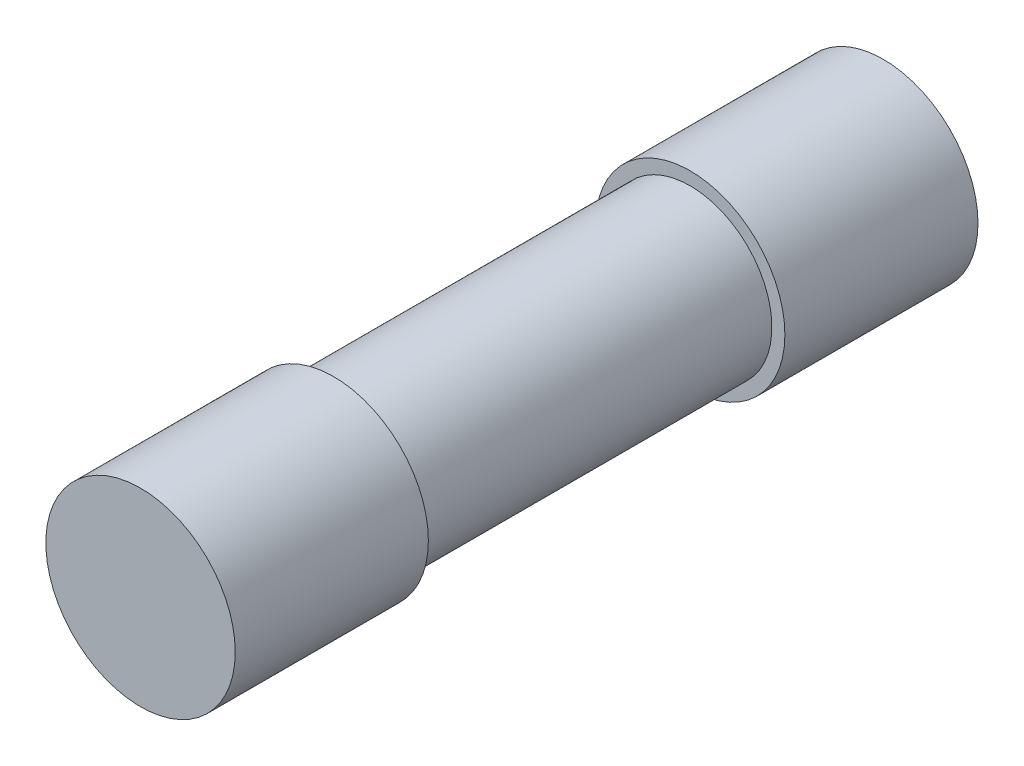
ISO-10303-21;
HEADER;
FILE_DESCRIPTION(('STEP AP214'),'2;1');
FILE_NAME('part.step','',(''),(''),'','','');
FILE_SCHEMA(('AUTOMOTIVE_DESIGN { 1 0 10303 214 1 1 1 1 }'));
ENDSEC;
DATA;
#1=APPLICATION_CONTEXT('core data for automotive mechanical design processes');
#2=APPLICATION_PROTOCOL_DEFINITION('international standard','automotive_design',2000,#1);
#3=PRODUCT_CONTEXT('',#1,'mechanical');
#4=PRODUCT('Part','Part','',(#3));
#5=PRODUCT_RELATED_PRODUCT_CATEGORY('part','',(#4));
#6=PRODUCT_DEFINITION_FORMATION('','',#4);
#7=PRODUCT_DEFINITION_CONTEXT('part definition',#1,'design');
#8=PRODUCT_DEFINITION('design','',#6,#7);
#9=PRODUCT_DEFINITION_SHAPE('','',#8);
#10=(LENGTH_UNIT() NAMED_UNIT(*) SI_UNIT(.MILLI.,.METRE.));
#11=(NAMED_UNIT(*) PLANE_ANGLE_UNIT() SI_UNIT($,.RADIAN.));
#12=(NAMED_UNIT(*) SI_UNIT($,.STERADIAN.) SOLID_ANGLE_UNIT());
#13=UNCERTAINTY_MEASURE_WITH_UNIT(LENGTH_MEASURE(1.E-05),#10,'distance_accuracy_value','');
#14=(GEOMETRIC_REPRESENTATION_CONTEXT(3) GLOBAL_UNCERTAINTY_ASSIGNED_CONTEXT((#13)) GLOBAL_UNIT_ASSIGNED_CONTEXT((#10,
#11,#12)) REPRESENTATION_CONTEXT('',''));
#15=CARTESIAN_POINT('',(0.,0.,0.));
#16=DIRECTION('',(0.,0.,1.));
#17=DIRECTION('',(1.,0.,0.));
#18=AXIS2_PLACEMENT_3D('',#15,#16,#17);
#19=CARTESIAN_POINT('',(0.,0.,-10.));
#20=DIRECTION('',(0.,0.,-1.));
#21=DIRECTION('',(-1.,0.,0.));
#22=AXIS2_PLACEMENT_3D('',#19,#20,#21);
#23=PLANE('',#22);
#24=CARTESIAN_POINT('',(0.,0.,-10.));
#25=DIRECTION('',(0.,0.,1.));
#26=DIRECTION('',(1.,0.,0.));
#27=AXIS2_PLACEMENT_3D('',#24,#25,#26);
#28=CIRCLE('',#27,2.55);
#29=CARTESIAN_POINT('',(2.55,0.,-10.));
#30=VERTEX_POINT('',#29);
#31=EDGE_CURVE('E16',#30,#30,#28,.T.);
#32=ORIENTED_EDGE('',*,*,#31,.F.);
#33=EDGE_LOOP('',(#32));
#34=FACE_BOUND('',#33,.T.);
#35=ADVANCED_FACE('F13',(#34),#23,.T.);
#36=CARTESIAN_POINT('',(0.,0.,10.));
#37=DIRECTION('',(0.,0.,-1.));
#38=DIRECTION('',(-1.,0.,0.));
#39=AXIS2_PLACEMENT_3D('',#36,#37,#38);
#40=PLANE('',#39);
#41=CARTESIAN_POINT('',(0.,0.,10.));
#42=DIRECTION('',(0.,0.,1.));
#43=DIRECTION('',(1.,0.,0.));
#44=AXIS2_PLACEMENT_3D('',#41,#42,#43);
#45=CIRCLE('',#44,2.55);
#46=CARTESIAN_POINT('',(2.55,0.,10.));
#47=VERTEX_POINT('',#46);
#48=EDGE_CURVE('E32',#47,#47,#45,.F.);
#49=ORIENTED_EDGE('',*,*,#48,.F.);
#50=EDGE_LOOP('',(#49));
#51=FACE_BOUND('',#50,.T.);
#52=ADVANCED_FACE('F42',(#51),#40,.F.);
#53=CARTESIAN_POINT('',(0.,0.,0.));
#54=DIRECTION('',(0.,0.,1.));
#55=DIRECTION('',(1.,0.,0.));
#56=AXIS2_PLACEMENT_3D('',#53,#54,#55);
#57=CYLINDRICAL_SURFACE('',#56,2.55);
#58=CARTESIAN_POINT('',(0.,0.,-4.8));
#59=DIRECTION('',(0.,0.,1.));
#60=DIRECTION('',(1.,0.,0.));
#61=AXIS2_PLACEMENT_3D('',#58,#59,#60);
#62=CIRCLE('',#61,2.55);
#63=CARTESIAN_POINT('',(2.55,0.,-4.8));
#64=VERTEX_POINT('',#63);
#65=EDGE_CURVE('E30',#64,#64,#62,.F.);
#66=ORIENTED_EDGE('',*,*,#65,.T.);
#67=EDGE_LOOP('',(#66));
#68=FACE_BOUND('',#67,.T.);
#69=ORIENTED_EDGE('',*,*,#31,.T.);
#70=EDGE_LOOP('',(#69));
#71=FACE_BOUND('',#70,.T.);
#72=ADVANCED_FACE('F39',(#68,#71),#57,.T.);
#73=CARTESIAN_POINT('',(0.,0.,0.));
#74=DIRECTION('',(0.,0.,1.));
#75=DIRECTION('',(1.,0.,0.));
#76=AXIS2_PLACEMENT_3D('',#73,#74,#75);
#77=CYLINDRICAL_SURFACE('',#76,2.55);
#78=ORIENTED_EDGE('',*,*,#48,.T.);
#79=EDGE_LOOP('',(#78));
#80=FACE_BOUND('',#79,.T.);
#81=CARTESIAN_POINT('',(0.,0.,4.8));
#82=DIRECTION('',(0.,0.,1.));
#83=DIRECTION('',(1.,0.,0.));
#84=AXIS2_PLACEMENT_3D('',#81,#82,#83);
#85=CIRCLE('',#84,2.55);
#86=CARTESIAN_POINT('',(2.55,0.,4.8));
#87=VERTEX_POINT('',#86);
#88=EDGE_CURVE('E25',#87,#87,#85,.F.);
#89=ORIENTED_EDGE('',*,*,#88,.F.);
#90=EDGE_LOOP('',(#89));
#91=FACE_BOUND('',#90,.T.);
#92=ADVANCED_FACE('F63',(#80,#91),#77,.T.);
#93=CARTESIAN_POINT('',(0.,0.,-4.8));
#94=DIRECTION('',(0.,0.,-1.));
#95=DIRECTION('',(-1.,0.,0.));
#96=AXIS2_PLACEMENT_3D('',#93,#94,#95);
#97=PLANE('',#96);
#98=CARTESIAN_POINT('',(0.,0.,-4.80000000075));
#99=DIRECTION('',(0.,0.,-1.));
#100=DIRECTION('',(-1.,0.,0.));
#101=AXIS2_PLACEMENT_3D('',#98,#99,#100);
#102=CIRCLE('',#101,2.2);
#103=CARTESIAN_POINT('',(-2.2,0.,-4.80000000075));
#104=VERTEX_POINT('',#103);
#105=EDGE_CURVE('E20',#104,#104,#102,.F.);
#106=ORIENTED_EDGE('',*,*,#105,.F.);
#107=EDGE_LOOP('',(#106));
#108=FACE_BOUND('',#107,.T.);
#109=ORIENTED_EDGE('',*,*,#65,.F.);
#110=EDGE_LOOP('',(#109));
#111=FACE_BOUND('',#110,.T.);
#112=ADVANCED_FACE('F57',(#108,#111),#97,.F.);
#113=CARTESIAN_POINT('',(0.,0.,4.8));
#114=DIRECTION('',(0.,0.,-1.));
#115=DIRECTION('',(-1.,0.,0.));
#116=AXIS2_PLACEMENT_3D('',#113,#114,#115);
#117=PLANE('',#116);
#118=CARTESIAN_POINT('',(0.,0.,4.80000000075));
#119=DIRECTION('',(0.,0.,-1.));
#120=DIRECTION('',(-1.,0.,0.));
#121=AXIS2_PLACEMENT_3D('',#118,#119,#120);
#122=CIRCLE('',#121,2.2);
#123=CARTESIAN_POINT('',(-2.2,0.,4.80000000075));
#124=VERTEX_POINT('',#123);
#125=EDGE_CURVE('E9',#124,#124,#122,.T.);
#126=ORIENTED_EDGE('',*,*,#125,.F.);
#127=EDGE_LOOP('',(#126));
#128=FACE_BOUND('',#127,.T.);
#129=ORIENTED_EDGE('',*,*,#88,.T.);
#130=EDGE_LOOP('',(#129));
#131=FACE_BOUND('',#130,.T.);
#132=ADVANCED_FACE('F50',(#128,#131),#117,.T.);
#133=CARTESIAN_POINT('',(0.,0.,0.));
#134=DIRECTION('',(0.,0.,-1.));
#135=DIRECTION('',(-1.,0.,0.));
#136=AXIS2_PLACEMENT_3D('',#133,#134,#135);
#137=CYLINDRICAL_SURFACE('',#136,2.2);
#138=ORIENTED_EDGE('',*,*,#105,.T.);
#139=EDGE_LOOP('',(#138));
#140=FACE_BOUND('',#139,.T.);
#141=ORIENTED_EDGE('',*,*,#125,.T.);
#142=EDGE_LOOP('',(#141));
#143=FACE_BOUND('',#142,.T.);
#144=ADVANCED_FACE('F48',(#140,#143),#137,.T.);
#145=CLOSED_SHELL('',(#35,#52,#72,#92,#112,#132,#144));
#146=MANIFOLD_SOLID_BREP('B1',#145);
#147=ADVANCED_BREP_SHAPE_REPRESENTATION('',(#18,#146),#14);
#148=SHAPE_DEFINITION_REPRESENTATION(#9,#147);
ENDSEC;
END-ISO-10303-21;
